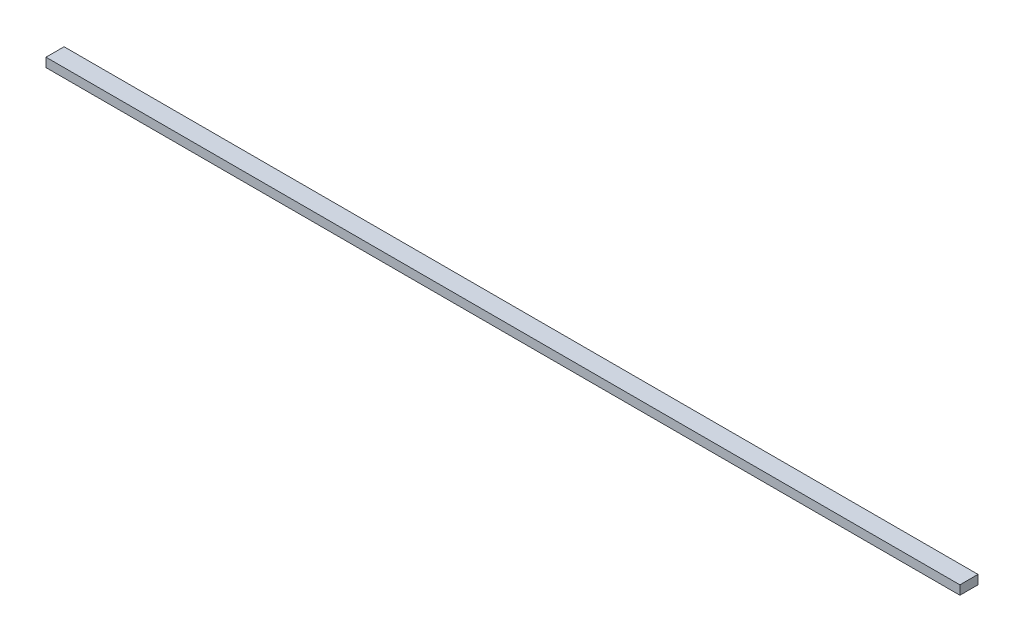
ISO-10303-21;
HEADER;
FILE_DESCRIPTION(('STEP AP214'),'2;1');
FILE_NAME('part.step','',(''),(''),'','','');
FILE_SCHEMA(('AUTOMOTIVE_DESIGN { 1 0 10303 214 1 1 1 1 }'));
ENDSEC;
DATA;
#1=APPLICATION_CONTEXT('core data for automotive mechanical design processes');
#2=APPLICATION_PROTOCOL_DEFINITION('international standard','automotive_design',2000,#1);
#3=PRODUCT_CONTEXT('',#1,'mechanical');
#4=PRODUCT('Part','Part','',(#3));
#5=PRODUCT_RELATED_PRODUCT_CATEGORY('part','',(#4));
#6=PRODUCT_DEFINITION_FORMATION('','',#4);
#7=PRODUCT_DEFINITION_CONTEXT('part definition',#1,'design');
#8=PRODUCT_DEFINITION('design','',#6,#7);
#9=PRODUCT_DEFINITION_SHAPE('','',#8);
#10=(LENGTH_UNIT() NAMED_UNIT(*) SI_UNIT(.MILLI.,.METRE.));
#11=(NAMED_UNIT(*) PLANE_ANGLE_UNIT() SI_UNIT($,.RADIAN.));
#12=(NAMED_UNIT(*) SI_UNIT($,.STERADIAN.) SOLID_ANGLE_UNIT());
#13=UNCERTAINTY_MEASURE_WITH_UNIT(LENGTH_MEASURE(1.E-05),#10,'distance_accuracy_value','');
#14=(GEOMETRIC_REPRESENTATION_CONTEXT(3) GLOBAL_UNCERTAINTY_ASSIGNED_CONTEXT((#13)) GLOBAL_UNIT_ASSIGNED_CONTEXT((#10,
#11,#12)) REPRESENTATION_CONTEXT('',''));
#15=CARTESIAN_POINT('',(0.,0.,0.));
#16=DIRECTION('',(0.,0.,1.));
#17=DIRECTION('',(1.,0.,0.));
#18=AXIS2_PLACEMENT_3D('',#15,#16,#17);
#19=CARTESIAN_POINT('',(-505.,10.,-9.99999999999993));
#20=DIRECTION('',(1.,0.,0.));
#21=DIRECTION('',(0.,0.,-1.));
#22=AXIS2_PLACEMENT_3D('',#19,#20,#21);
#23=PLANE('',#22);
#24=DIRECTION('',(0.,0.,1.));
#25=VECTOR('',#24,1.);
#26=CARTESIAN_POINT('',(-505.,0.,-9.99999999999993));
#27=LINE('',#26,#25);
#28=CARTESIAN_POINT('',(-505.,0.,-9.99999999999993));
#29=VERTEX_POINT('',#28);
#30=CARTESIAN_POINT('',(-505.,0.,10.0000000000001));
#31=VERTEX_POINT('',#30);
#32=EDGE_CURVE('E98',#29,#31,#27,.T.);
#33=ORIENTED_EDGE('',*,*,#32,.T.);
#34=DIRECTION('',(0.,-1.,0.));
#35=VECTOR('',#34,1.);
#36=CARTESIAN_POINT('',(-505.,10.,10.0000000000001));
#37=LINE('',#36,#35);
#38=CARTESIAN_POINT('',(-505.,10.,10.0000000000001));
#39=VERTEX_POINT('',#38);
#40=EDGE_CURVE('E11',#39,#31,#37,.T.);
#41=ORIENTED_EDGE('',*,*,#40,.F.);
#42=DIRECTION('',(0.,0.,1.));
#43=VECTOR('',#42,1.);
#44=CARTESIAN_POINT('',(-505.,10.,-9.99999999999993));
#45=LINE('',#44,#43);
#46=CARTESIAN_POINT('',(-505.,10.,-9.99999999999993));
#47=VERTEX_POINT('',#46);
#48=EDGE_CURVE('E86',#47,#39,#45,.T.);
#49=ORIENTED_EDGE('',*,*,#48,.F.);
#50=DIRECTION('',(0.,-1.,0.));
#51=VECTOR('',#50,1.);
#52=CARTESIAN_POINT('',(-505.,10.,-9.99999999999993));
#53=LINE('',#52,#51);
#54=EDGE_CURVE('E94',#47,#29,#53,.T.);
#55=ORIENTED_EDGE('',*,*,#54,.T.);
#56=EDGE_LOOP('',(#33,#41,#49,#55));
#57=FACE_BOUND('',#56,.T.);
#58=ADVANCED_FACE('F35',(#57),#23,.F.);
#59=CARTESIAN_POINT('',(-505.,10.,10.0000000000001));
#60=DIRECTION('',(0.,0.,-1.));
#61=DIRECTION('',(-1.,0.,0.));
#62=AXIS2_PLACEMENT_3D('',#59,#60,#61);
#63=PLANE('',#62);
#64=DIRECTION('',(1.,0.,0.));
#65=VECTOR('',#64,1.);
#66=CARTESIAN_POINT('',(-505.,0.,10.0000000000001));
#67=LINE('',#66,#65);
#68=CARTESIAN_POINT('',(505.,0.,10.0000000000001));
#69=VERTEX_POINT('',#68);
#70=EDGE_CURVE('E90',#31,#69,#67,.T.);
#71=ORIENTED_EDGE('',*,*,#70,.T.);
#72=DIRECTION('',(0.,-1.,0.));
#73=VECTOR('',#72,1.);
#74=CARTESIAN_POINT('',(505.,10.,10.0000000000001));
#75=LINE('',#74,#73);
#76=CARTESIAN_POINT('',(505.,10.,10.0000000000001));
#77=VERTEX_POINT('',#76);
#78=EDGE_CURVE('E43',#77,#69,#75,.T.);
#79=ORIENTED_EDGE('',*,*,#78,.F.);
#80=DIRECTION('',(1.,0.,0.));
#81=VECTOR('',#80,1.);
#82=CARTESIAN_POINT('',(-505.,10.,10.0000000000001));
#83=LINE('',#82,#81);
#84=EDGE_CURVE('E81',#39,#77,#83,.T.);
#85=ORIENTED_EDGE('',*,*,#84,.F.);
#86=ORIENTED_EDGE('',*,*,#40,.T.);
#87=EDGE_LOOP('',(#71,#79,#85,#86));
#88=FACE_BOUND('',#87,.T.);
#89=ADVANCED_FACE('F89',(#88),#63,.F.);
#90=CARTESIAN_POINT('',(505.,10.,-9.99999999999993));
#91=DIRECTION('',(-1.,0.,0.));
#92=DIRECTION('',(0.,0.,1.));
#93=AXIS2_PLACEMENT_3D('',#90,#91,#92);
#94=PLANE('',#93);
#95=DIRECTION('',(0.,0.,-1.));
#96=VECTOR('',#95,1.);
#97=CARTESIAN_POINT('',(505.,0.,-9.99999999999993));
#98=LINE('',#97,#96);
#99=CARTESIAN_POINT('',(505.,0.,-9.99999999999993));
#100=VERTEX_POINT('',#99);
#101=EDGE_CURVE('E68',#69,#100,#98,.T.);
#102=ORIENTED_EDGE('',*,*,#101,.T.);
#103=DIRECTION('',(0.,-1.,0.));
#104=VECTOR('',#103,1.);
#105=CARTESIAN_POINT('',(505.,10.,-9.99999999999993));
#106=LINE('',#105,#104);
#107=CARTESIAN_POINT('',(505.,10.,-9.99999999999993));
#108=VERTEX_POINT('',#107);
#109=EDGE_CURVE('E91',#108,#100,#106,.T.);
#110=ORIENTED_EDGE('',*,*,#109,.F.);
#111=DIRECTION('',(0.,0.,-1.));
#112=VECTOR('',#111,1.);
#113=CARTESIAN_POINT('',(505.,10.,-9.99999999999993));
#114=LINE('',#113,#112);
#115=EDGE_CURVE('E84',#77,#108,#114,.T.);
#116=ORIENTED_EDGE('',*,*,#115,.F.);
#117=ORIENTED_EDGE('',*,*,#78,.T.);
#118=EDGE_LOOP('',(#102,#110,#116,#117));
#119=FACE_BOUND('',#118,.T.);
#120=ADVANCED_FACE('F92',(#119),#94,.F.);
#121=CARTESIAN_POINT('',(-505.,10.,-9.99999999999993));
#122=DIRECTION('',(0.,0.,1.));
#123=DIRECTION('',(1.,0.,0.));
#124=AXIS2_PLACEMENT_3D('',#121,#122,#123);
#125=PLANE('',#124);
#126=DIRECTION('',(-1.,0.,0.));
#127=VECTOR('',#126,1.);
#128=CARTESIAN_POINT('',(-505.,0.,-9.99999999999993));
#129=LINE('',#128,#127);
#130=EDGE_CURVE('E74',#100,#29,#129,.T.);
#131=ORIENTED_EDGE('',*,*,#130,.T.);
#132=ORIENTED_EDGE('',*,*,#54,.F.);
#133=DIRECTION('',(-1.,0.,0.));
#134=VECTOR('',#133,1.);
#135=CARTESIAN_POINT('',(-505.,10.,-9.99999999999993));
#136=LINE('',#135,#134);
#137=EDGE_CURVE('E51',#108,#47,#136,.T.);
#138=ORIENTED_EDGE('',*,*,#137,.F.);
#139=ORIENTED_EDGE('',*,*,#109,.T.);
#140=EDGE_LOOP('',(#131,#132,#138,#139));
#141=FACE_BOUND('',#140,.T.);
#142=ADVANCED_FACE('F105',(#141),#125,.F.);
#143=CARTESIAN_POINT('',(0.,10.,0.));
#144=DIRECTION('',(0.,1.,0.));
#145=DIRECTION('',(0.,0.,1.));
#146=AXIS2_PLACEMENT_3D('',#143,#144,#145);
#147=PLANE('',#146);
#148=ORIENTED_EDGE('',*,*,#48,.T.);
#149=ORIENTED_EDGE('',*,*,#84,.T.);
#150=ORIENTED_EDGE('',*,*,#115,.T.);
#151=ORIENTED_EDGE('',*,*,#137,.T.);
#152=EDGE_LOOP('',(#148,#149,#150,#151));
#153=FACE_BOUND('',#152,.T.);
#154=ADVANCED_FACE('F82',(#153),#147,.T.);
#155=CARTESIAN_POINT('',(0.,0.,0.));
#156=DIRECTION('',(0.,1.,0.));
#157=DIRECTION('',(0.,0.,1.));
#158=AXIS2_PLACEMENT_3D('',#155,#156,#157);
#159=PLANE('',#158);
#160=ORIENTED_EDGE('',*,*,#32,.F.);
#161=ORIENTED_EDGE('',*,*,#130,.F.);
#162=ORIENTED_EDGE('',*,*,#101,.F.);
#163=ORIENTED_EDGE('',*,*,#70,.F.);
#164=EDGE_LOOP('',(#160,#161,#162,#163));
#165=FACE_BOUND('',#164,.T.);
#166=ADVANCED_FACE('F108',(#165),#159,.F.);
#167=CLOSED_SHELL('',(#58,#89,#120,#142,#154,#166));
#168=MANIFOLD_SOLID_BREP('B2',#167);
#169=ADVANCED_BREP_SHAPE_REPRESENTATION('',(#18,#168),#14);
#170=SHAPE_DEFINITION_REPRESENTATION(#9,#169);
ENDSEC;
END-ISO-10303-21;
